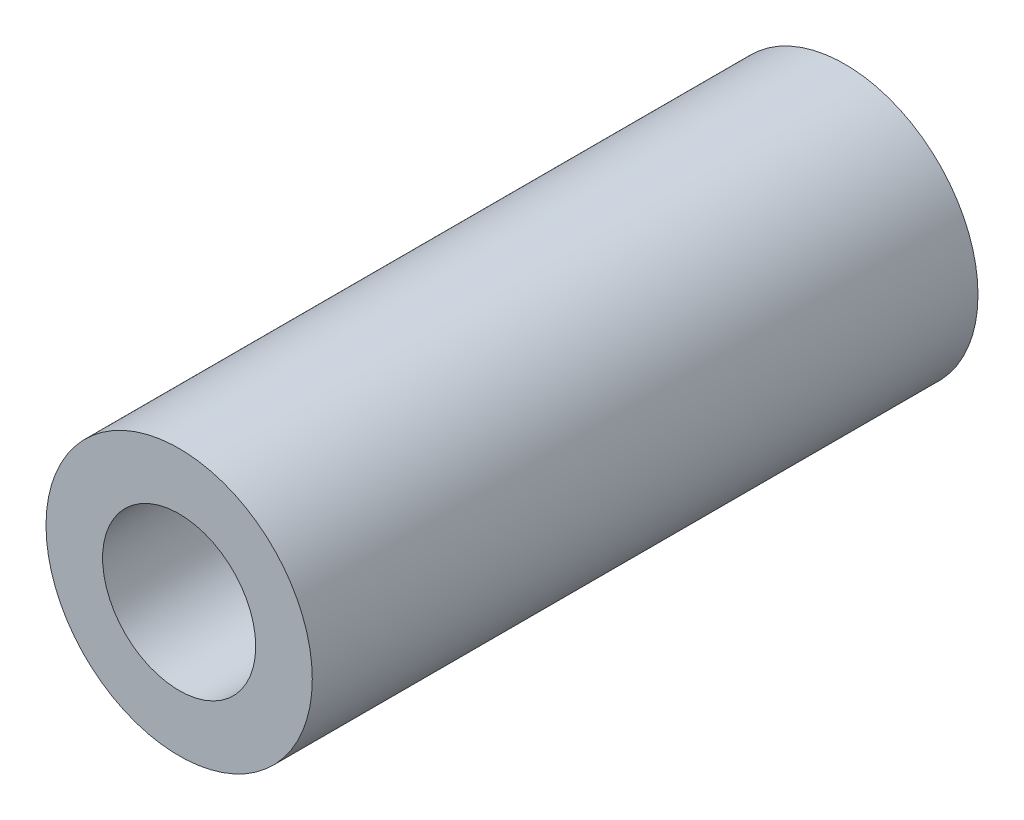
ISO-10303-21;
HEADER;
FILE_DESCRIPTION(('STEP AP214'),'2;1');
FILE_NAME('part.step','',(''),(''),'','','');
FILE_SCHEMA(('AUTOMOTIVE_DESIGN { 1 0 10303 214 1 1 1 1 }'));
ENDSEC;
DATA;
#1=APPLICATION_CONTEXT('core data for automotive mechanical design processes');
#2=APPLICATION_PROTOCOL_DEFINITION('international standard','automotive_design',2000,#1);
#3=PRODUCT_CONTEXT('',#1,'mechanical');
#4=PRODUCT('Part','Part','',(#3));
#5=PRODUCT_RELATED_PRODUCT_CATEGORY('part','',(#4));
#6=PRODUCT_DEFINITION_FORMATION('','',#4);
#7=PRODUCT_DEFINITION_CONTEXT('part definition',#1,'design');
#8=PRODUCT_DEFINITION('design','',#6,#7);
#9=PRODUCT_DEFINITION_SHAPE('','',#8);
#10=(LENGTH_UNIT() NAMED_UNIT(*) SI_UNIT(.MILLI.,.METRE.));
#11=(NAMED_UNIT(*) PLANE_ANGLE_UNIT() SI_UNIT($,.RADIAN.));
#12=(NAMED_UNIT(*) SI_UNIT($,.STERADIAN.) SOLID_ANGLE_UNIT());
#13=UNCERTAINTY_MEASURE_WITH_UNIT(LENGTH_MEASURE(1.E-05),#10,'distance_accuracy_value','');
#14=(GEOMETRIC_REPRESENTATION_CONTEXT(3) GLOBAL_UNCERTAINTY_ASSIGNED_CONTEXT((#13)) GLOBAL_UNIT_ASSIGNED_CONTEXT((#10,
#11,#12)) REPRESENTATION_CONTEXT('',''));
#15=CARTESIAN_POINT('',(0.,0.,0.));
#16=DIRECTION('',(0.,0.,1.));
#17=DIRECTION('',(1.,0.,0.));
#18=AXIS2_PLACEMENT_3D('',#15,#16,#17);
#19=CARTESIAN_POINT('',(-11.9027324487123,30.0594429636971,10.));
#20=DIRECTION('',(0.,0.,-1.));
#21=DIRECTION('',(-1.,0.,0.));
#22=AXIS2_PLACEMENT_3D('',#19,#20,#21);
#23=CYLINDRICAL_SURFACE('',#22,2.);
#24=CARTESIAN_POINT('',(-11.9027324487123,30.0594429636971,10.));
#25=DIRECTION('',(0.,0.,1.));
#26=DIRECTION('',(1.,0.,0.));
#27=AXIS2_PLACEMENT_3D('',#24,#25,#26);
#28=CIRCLE('',#27,2.);
#29=CARTESIAN_POINT('',(-9.90273244871227,30.0594429636971,10.));
#30=VERTEX_POINT('',#29);
#31=EDGE_CURVE('E10',#30,#30,#28,.T.);
#32=ORIENTED_EDGE('',*,*,#31,.F.);
#33=EDGE_LOOP('',(#32));
#34=FACE_BOUND('',#33,.T.);
#35=CARTESIAN_POINT('',(-11.9027324487123,30.0594429636971,0.));
#36=DIRECTION('',(0.,0.,1.));
#37=DIRECTION('',(1.,0.,0.));
#38=AXIS2_PLACEMENT_3D('',#35,#36,#37);
#39=CIRCLE('',#38,2.);
#40=CARTESIAN_POINT('',(-9.90273244871227,30.0594429636971,0.));
#41=VERTEX_POINT('',#40);
#42=EDGE_CURVE('E44',#41,#41,#39,.T.);
#43=ORIENTED_EDGE('',*,*,#42,.T.);
#44=EDGE_LOOP('',(#43));
#45=FACE_BOUND('',#44,.T.);
#46=ADVANCED_FACE('F41',(#34,#45),#23,.T.);
#47=CARTESIAN_POINT('',(-11.9027324487123,30.0594429636971,10.));
#48=DIRECTION('',(0.,0.,1.));
#49=DIRECTION('',(1.,0.,0.));
#50=AXIS2_PLACEMENT_3D('',#47,#48,#49);
#51=PLANE('',#50);
#52=CARTESIAN_POINT('',(-11.9027324487123,30.0594429636971,10.));
#53=DIRECTION('',(0.,0.,1.));
#54=DIRECTION('',(1.,0.,0.));
#55=AXIS2_PLACEMENT_3D('',#52,#53,#54);
#56=CIRCLE('',#55,1.15);
#57=CARTESIAN_POINT('',(-10.7527324487123,30.0594429636971,10.));
#58=VERTEX_POINT('',#57);
#59=EDGE_CURVE('E55',#58,#58,#56,.T.);
#60=ORIENTED_EDGE('',*,*,#59,.F.);
#61=EDGE_LOOP('',(#60));
#62=FACE_BOUND('',#61,.T.);
#63=ORIENTED_EDGE('',*,*,#31,.T.);
#64=EDGE_LOOP('',(#63));
#65=FACE_BOUND('',#64,.T.);
#66=ADVANCED_FACE('F72',(#62,#65),#51,.T.);
#67=CARTESIAN_POINT('',(-11.9027324487123,30.0594429636971,0.));
#68=DIRECTION('',(0.,0.,1.));
#69=DIRECTION('',(1.,0.,0.));
#70=AXIS2_PLACEMENT_3D('',#67,#68,#69);
#71=PLANE('',#70);
#72=CARTESIAN_POINT('',(-11.9027324487123,30.0594429636971,0.));
#73=DIRECTION('',(0.,0.,1.));
#74=DIRECTION('',(1.,0.,0.));
#75=AXIS2_PLACEMENT_3D('',#72,#73,#74);
#76=CIRCLE('',#75,1.15);
#77=CARTESIAN_POINT('',(-10.7527324487123,30.0594429636971,0.));
#78=VERTEX_POINT('',#77);
#79=EDGE_CURVE('E53',#78,#78,#76,.T.);
#80=ORIENTED_EDGE('',*,*,#79,.T.);
#81=EDGE_LOOP('',(#80));
#82=FACE_BOUND('',#81,.T.);
#83=ORIENTED_EDGE('',*,*,#42,.F.);
#84=EDGE_LOOP('',(#83));
#85=FACE_BOUND('',#84,.T.);
#86=ADVANCED_FACE('F63',(#82,#85),#71,.F.);
#87=CARTESIAN_POINT('',(-11.9027324487123,30.0594429636971,0.));
#88=DIRECTION('',(0.,0.,1.));
#89=DIRECTION('',(1.,0.,0.));
#90=AXIS2_PLACEMENT_3D('',#87,#88,#89);
#91=CYLINDRICAL_SURFACE('',#90,1.15);
#92=ORIENTED_EDGE('',*,*,#79,.F.);
#93=EDGE_LOOP('',(#92));
#94=FACE_BOUND('',#93,.T.);
#95=ORIENTED_EDGE('',*,*,#59,.T.);
#96=EDGE_LOOP('',(#95));
#97=FACE_BOUND('',#96,.T.);
#98=ADVANCED_FACE('F66',(#94,#97),#91,.F.);
#99=CLOSED_SHELL('',(#46,#66,#86,#98));
#100=MANIFOLD_SOLID_BREP('B2',#99);
#101=ADVANCED_BREP_SHAPE_REPRESENTATION('',(#18,#100),#14);
#102=SHAPE_DEFINITION_REPRESENTATION(#9,#101);
ENDSEC;
END-ISO-10303-21;
